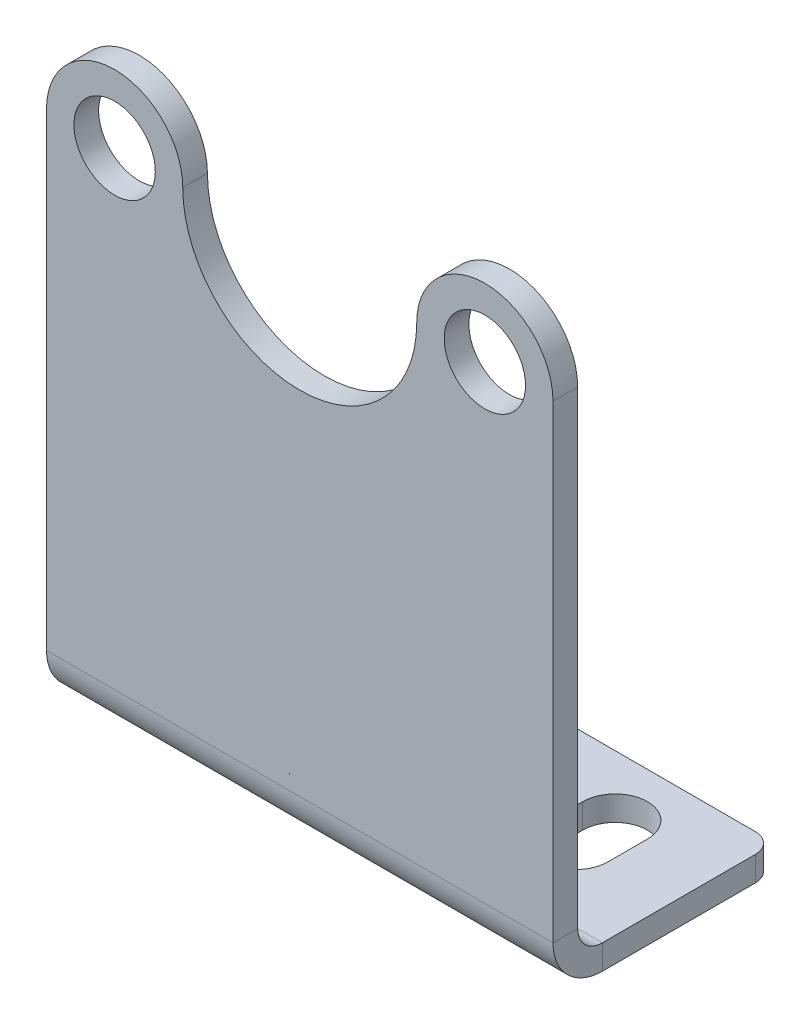
ISO-10303-21;
HEADER;
FILE_DESCRIPTION(('STEP AP214'),'2;1');
FILE_NAME('part.step','',(''),(''),'','','');
FILE_SCHEMA(('AUTOMOTIVE_DESIGN { 1 0 10303 214 1 1 1 1 }'));
ENDSEC;
DATA;
#1=APPLICATION_CONTEXT('core data for automotive mechanical design processes');
#2=APPLICATION_PROTOCOL_DEFINITION('international standard','automotive_design',2000,#1);
#3=PRODUCT_CONTEXT('',#1,'mechanical');
#4=PRODUCT('Part','Part','',(#3));
#5=PRODUCT_RELATED_PRODUCT_CATEGORY('part','',(#4));
#6=PRODUCT_DEFINITION_FORMATION('','',#4);
#7=PRODUCT_DEFINITION_CONTEXT('part definition',#1,'design');
#8=PRODUCT_DEFINITION('design','',#6,#7);
#9=PRODUCT_DEFINITION_SHAPE('','',#8);
#10=(LENGTH_UNIT() NAMED_UNIT(*) SI_UNIT(.MILLI.,.METRE.));
#11=(NAMED_UNIT(*) PLANE_ANGLE_UNIT() SI_UNIT($,.RADIAN.));
#12=(NAMED_UNIT(*) SI_UNIT($,.STERADIAN.) SOLID_ANGLE_UNIT());
#13=UNCERTAINTY_MEASURE_WITH_UNIT(LENGTH_MEASURE(1.E-05),#10,'distance_accuracy_value','');
#14=(GEOMETRIC_REPRESENTATION_CONTEXT(3) GLOBAL_UNCERTAINTY_ASSIGNED_CONTEXT((#13)) GLOBAL_UNIT_ASSIGNED_CONTEXT((#10,
#11,#12)) REPRESENTATION_CONTEXT('',''));
#15=CARTESIAN_POINT('',(0.,0.,0.));
#16=DIRECTION('',(0.,0.,1.));
#17=DIRECTION('',(1.,0.,0.));
#18=AXIS2_PLACEMENT_3D('',#15,#16,#17);
#19=CARTESIAN_POINT('',(-32.6263000000001,-14.5102681181538,0.));
#20=DIRECTION('',(-1.,0.,0.));
#21=DIRECTION('',(0.,-1.,0.));
#22=AXIS2_PLACEMENT_3D('',#19,#20,#21);
#23=PLANE('',#22);
#24=DIRECTION('',(0.,0.,-1.));
#25=VECTOR('',#24,1.);
#26=CARTESIAN_POINT('',(-32.6263000000001,-74.8352681181538,0.));
#27=LINE('',#26,#25);
#28=CARTESIAN_POINT('',(-32.6263000000001,-74.8352681181538,3.175));
#29=VERTEX_POINT('',#28);
#30=CARTESIAN_POINT('',(-32.6263000000001,-74.8352681181538,0.));
#31=VERTEX_POINT('',#30);
#32=EDGE_CURVE('E11',#29,#31,#27,.T.);
#33=ORIENTED_EDGE('',*,*,#32,.F.);
#34=DIRECTION('',(0.,1.,0.));
#35=VECTOR('',#34,1.);
#36=CARTESIAN_POINT('',(-32.6263000000001,-14.5102681181538,3.175));
#37=LINE('',#36,#35);
#38=CARTESIAN_POINT('',(-32.6263000000001,-14.5102681181538,3.175));
#39=VERTEX_POINT('',#38);
#40=EDGE_CURVE('E197',#39,#29,#37,.F.);
#41=ORIENTED_EDGE('',*,*,#40,.F.);
#42=DIRECTION('',(0.,0.,-1.));
#43=VECTOR('',#42,1.);
#44=CARTESIAN_POINT('',(-32.6263000000001,-14.5102681181538,0.));
#45=LINE('',#44,#43);
#46=CARTESIAN_POINT('',(-32.6263000000001,-14.5102681181538,0.));
#47=VERTEX_POINT('',#46);
#48=EDGE_CURVE('E53',#39,#47,#45,.T.);
#49=ORIENTED_EDGE('',*,*,#48,.T.);
#50=DIRECTION('',(0.,-1.,0.));
#51=VECTOR('',#50,1.);
#52=CARTESIAN_POINT('',(-32.6263000000001,-14.5102681181538,0.));
#53=LINE('',#52,#51);
#54=EDGE_CURVE('E289',#47,#31,#53,.T.);
#55=ORIENTED_EDGE('',*,*,#54,.T.);
#56=EDGE_LOOP('',(#33,#41,#49,#55));
#57=FACE_BOUND('',#56,.T.);
#58=ADVANCED_FACE('F42',(#57),#23,.T.);
#59=CARTESIAN_POINT('',(-23.8633000000001,-14.5102681181538,0.));
#60=DIRECTION('',(0.,0.,1.));
#61=DIRECTION('',(1.,0.,0.));
#62=AXIS2_PLACEMENT_3D('',#59,#60,#61);
#63=CYLINDRICAL_SURFACE('',#62,8.763);
#64=ORIENTED_EDGE('',*,*,#48,.F.);
#65=CARTESIAN_POINT('',(-23.8633000000001,-14.5102681181538,3.175));
#66=DIRECTION('',(0.,0.,1.));
#67=DIRECTION('',(1.,0.,0.));
#68=AXIS2_PLACEMENT_3D('',#65,#66,#67);
#69=CIRCLE('',#68,8.763);
#70=CARTESIAN_POINT('',(-15.1003000000001,-14.5102681181538,3.175));
#71=VERTEX_POINT('',#70);
#72=EDGE_CURVE('E207',#71,#39,#69,.T.);
#73=ORIENTED_EDGE('',*,*,#72,.F.);
#74=DIRECTION('',(0.,0.,-1.));
#75=VECTOR('',#74,1.);
#76=CARTESIAN_POINT('',(-15.1003000000001,-14.5102681181538,0.));
#77=LINE('',#76,#75);
#78=CARTESIAN_POINT('',(-15.1003000000001,-14.5102681181538,0.));
#79=VERTEX_POINT('',#78);
#80=EDGE_CURVE('E281',#71,#79,#77,.T.);
#81=ORIENTED_EDGE('',*,*,#80,.T.);
#82=CARTESIAN_POINT('',(-23.8633000000001,-14.5102681181538,0.));
#83=DIRECTION('',(0.,0.,1.));
#84=DIRECTION('',(1.,0.,0.));
#85=AXIS2_PLACEMENT_3D('',#82,#83,#84);
#86=CIRCLE('',#85,8.763);
#87=EDGE_CURVE('E302',#79,#47,#86,.T.);
#88=ORIENTED_EDGE('',*,*,#87,.T.);
#89=EDGE_LOOP('',(#64,#73,#81,#88));
#90=FACE_BOUND('',#89,.T.);
#91=ADVANCED_FACE('F309',(#90),#63,.T.);
#92=CARTESIAN_POINT('',(-0.0507999999999507,-14.5102681181538,0.));
#93=DIRECTION('',(0.,0.,1.));
#94=DIRECTION('',(1.,0.,0.));
#95=AXIS2_PLACEMENT_3D('',#92,#93,#94);
#96=CYLINDRICAL_SURFACE('',#95,15.0495000000001);
#97=ORIENTED_EDGE('',*,*,#80,.F.);
#98=CARTESIAN_POINT('',(-0.0507999999999507,-14.5102681181538,3.175));
#99=DIRECTION('',(0.,0.,-1.));
#100=DIRECTION('',(-1.,0.,0.));
#101=AXIS2_PLACEMENT_3D('',#98,#99,#100);
#102=CIRCLE('',#101,15.0495000000001);
#103=CARTESIAN_POINT('',(14.9987000000002,-14.5102681181538,3.175));
#104=VERTEX_POINT('',#103);
#105=EDGE_CURVE('E203',#104,#71,#102,.T.);
#106=ORIENTED_EDGE('',*,*,#105,.F.);
#107=DIRECTION('',(0.,0.,-1.));
#108=VECTOR('',#107,1.);
#109=CARTESIAN_POINT('',(14.9987000000002,-14.5102681181538,0.));
#110=LINE('',#109,#108);
#111=CARTESIAN_POINT('',(14.9987000000002,-14.5102681181538,0.));
#112=VERTEX_POINT('',#111);
#113=EDGE_CURVE('E277',#104,#112,#110,.T.);
#114=ORIENTED_EDGE('',*,*,#113,.T.);
#115=CARTESIAN_POINT('',(-0.0507999999999507,-14.5102681181538,0.));
#116=DIRECTION('',(0.,0.,-1.));
#117=DIRECTION('',(1.,0.,0.));
#118=AXIS2_PLACEMENT_3D('',#115,#116,#117);
#119=CIRCLE('',#118,15.0495000000001);
#120=EDGE_CURVE('E311',#112,#79,#119,.T.);
#121=ORIENTED_EDGE('',*,*,#120,.T.);
#122=EDGE_LOOP('',(#97,#106,#114,#121));
#123=FACE_BOUND('',#122,.T.);
#124=ADVANCED_FACE('F484',(#123),#96,.F.);
#125=CARTESIAN_POINT('',(23.7617000000002,-14.5102681181538,0.));
#126=DIRECTION('',(0.,0.,1.));
#127=DIRECTION('',(1.,0.,0.));
#128=AXIS2_PLACEMENT_3D('',#125,#126,#127);
#129=CYLINDRICAL_SURFACE('',#128,8.76299999999999);
#130=ORIENTED_EDGE('',*,*,#113,.F.);
#131=CARTESIAN_POINT('',(23.7617000000002,-14.5102681181538,3.175));
#132=DIRECTION('',(0.,0.,1.));
#133=DIRECTION('',(1.,0.,0.));
#134=AXIS2_PLACEMENT_3D('',#131,#132,#133);
#135=CIRCLE('',#134,8.76299999999999);
#136=CARTESIAN_POINT('',(32.5247000000001,-14.5102681181538,3.175));
#137=VERTEX_POINT('',#136);
#138=EDGE_CURVE('E198',#137,#104,#135,.T.);
#139=ORIENTED_EDGE('',*,*,#138,.F.);
#140=DIRECTION('',(0.,0.,-1.));
#141=VECTOR('',#140,1.);
#142=CARTESIAN_POINT('',(32.5247000000001,-14.5102681181538,0.));
#143=LINE('',#142,#141);
#144=CARTESIAN_POINT('',(32.5247000000001,-14.5102681181538,0.));
#145=VERTEX_POINT('',#144);
#146=EDGE_CURVE('E273',#137,#145,#143,.T.);
#147=ORIENTED_EDGE('',*,*,#146,.T.);
#148=CARTESIAN_POINT('',(23.7617000000002,-14.5102681181538,0.));
#149=DIRECTION('',(0.,0.,1.));
#150=DIRECTION('',(1.,0.,0.));
#151=AXIS2_PLACEMENT_3D('',#148,#149,#150);
#152=CIRCLE('',#151,8.76299999999999);
#153=EDGE_CURVE('E315',#145,#112,#152,.T.);
#154=ORIENTED_EDGE('',*,*,#153,.T.);
#155=EDGE_LOOP('',(#130,#139,#147,#154));
#156=FACE_BOUND('',#155,.T.);
#157=ADVANCED_FACE('F814',(#156),#129,.T.);
#158=CARTESIAN_POINT('',(32.5247000000002,-81.1852681181538,0.));
#159=DIRECTION('',(1.,0.,0.));
#160=DIRECTION('',(0.,1.,0.));
#161=AXIS2_PLACEMENT_3D('',#158,#159,#160);
#162=PLANE('',#161);
#163=ORIENTED_EDGE('',*,*,#146,.F.);
#164=DIRECTION('',(0.,1.,0.));
#165=VECTOR('',#164,1.);
#166=CARTESIAN_POINT('',(32.5247000000002,-14.5102681181538,3.175));
#167=LINE('',#166,#165);
#168=CARTESIAN_POINT('',(32.5247000000002,-74.8352681181538,3.175));
#169=VERTEX_POINT('',#168);
#170=EDGE_CURVE('E193',#169,#137,#167,.T.);
#171=ORIENTED_EDGE('',*,*,#170,.F.);
#172=DIRECTION('',(0.,0.,-1.));
#173=VECTOR('',#172,1.);
#174=CARTESIAN_POINT('',(32.5247000000002,-74.8352681181538,0.));
#175=LINE('',#174,#173);
#176=CARTESIAN_POINT('',(32.5247000000002,-74.8352681181538,0.));
#177=VERTEX_POINT('',#176);
#178=EDGE_CURVE('E269',#169,#177,#175,.T.);
#179=ORIENTED_EDGE('',*,*,#178,.T.);
#180=DIRECTION('',(0.,1.,0.));
#181=VECTOR('',#180,1.);
#182=CARTESIAN_POINT('',(32.5247000000002,-81.1852681181538,0.));
#183=LINE('',#182,#181);
#184=EDGE_CURVE('E307',#177,#145,#183,.T.);
#185=ORIENTED_EDGE('',*,*,#184,.T.);
#186=EDGE_LOOP('',(#163,#171,#179,#185));
#187=FACE_BOUND('',#186,.T.);
#188=ADVANCED_FACE('F477',(#187),#162,.T.);
#189=CARTESIAN_POINT('',(32.5247000000002,-74.8352681181538,-3.175));
#190=DIRECTION('',(1.,0.,0.));
#191=DIRECTION('',(0.,1.,0.));
#192=AXIS2_PLACEMENT_3D('',#189,#190,#191);
#193=PLANE('',#192);
#194=ORIENTED_EDGE('',*,*,#178,.F.);
#195=CARTESIAN_POINT('',(32.5247000000002,-74.8352681181538,-3.175));
#196=DIRECTION('',(-1.,0.,0.));
#197=DIRECTION('',(0.,0.,1.));
#198=AXIS2_PLACEMENT_3D('',#195,#196,#197);
#199=CIRCLE('',#198,6.35);
#200=CARTESIAN_POINT('',(32.5247000000002,-81.1852681181538,-3.175));
#201=VERTEX_POINT('',#200);
#202=EDGE_CURVE('E166',#169,#201,#199,.F.);
#203=ORIENTED_EDGE('',*,*,#202,.T.);
#204=DIRECTION('',(0.,1.,0.));
#205=VECTOR('',#204,1.);
#206=CARTESIAN_POINT('',(32.5247000000002,-78.0102681181538,-3.175));
#207=LINE('',#206,#205);
#208=CARTESIAN_POINT('',(32.5247000000002,-78.0102681181538,-3.175));
#209=VERTEX_POINT('',#208);
#210=EDGE_CURVE('E61',#201,#209,#207,.T.);
#211=ORIENTED_EDGE('',*,*,#210,.T.);
#212=CARTESIAN_POINT('',(32.5247000000002,-74.8352681181538,-3.175));
#213=DIRECTION('',(-1.,0.,0.));
#214=DIRECTION('',(0.,-1.,0.));
#215=AXIS2_PLACEMENT_3D('',#212,#213,#214);
#216=CIRCLE('',#215,3.175);
#217=EDGE_CURVE('E388',#177,#209,#216,.F.);
#218=ORIENTED_EDGE('',*,*,#217,.F.);
#219=EDGE_LOOP('',(#194,#203,#211,#218));
#220=FACE_BOUND('',#219,.T.);
#221=ADVANCED_FACE('F470',(#220),#193,.T.);
#222=CARTESIAN_POINT('',(32.5247000000002,-78.0102681181538,-25.4));
#223=DIRECTION('',(-1.,0.,0.));
#224=DIRECTION('',(0.,0.,1.));
#225=AXIS2_PLACEMENT_3D('',#222,#223,#224);
#226=PLANE('',#225);
#227=ORIENTED_EDGE('',*,*,#210,.F.);
#228=DIRECTION('',(0.,0.,1.));
#229=VECTOR('',#228,1.);
#230=CARTESIAN_POINT('',(32.5247000000002,-81.1852681181538,-25.4));
#231=LINE('',#230,#229);
#232=CARTESIAN_POINT('',(32.5247000000002,-81.1852681181538,-22.86));
#233=VERTEX_POINT('',#232);
#234=EDGE_CURVE('E156',#233,#201,#231,.T.);
#235=ORIENTED_EDGE('',*,*,#234,.F.);
#236=DIRECTION('',(0.,1.,0.));
#237=VECTOR('',#236,1.);
#238=CARTESIAN_POINT('',(32.5247000000002,-78.0102681181538,-22.86));
#239=LINE('',#238,#237);
#240=CARTESIAN_POINT('',(32.5247000000002,-78.0102681181538,-22.86));
#241=VERTEX_POINT('',#240);
#242=EDGE_CURVE('E263',#233,#241,#239,.T.);
#243=ORIENTED_EDGE('',*,*,#242,.T.);
#244=DIRECTION('',(0.,0.,1.));
#245=VECTOR('',#244,1.);
#246=CARTESIAN_POINT('',(32.5247000000002,-78.0102681181538,-25.4));
#247=LINE('',#246,#245);
#248=EDGE_CURVE('E373',#241,#209,#247,.T.);
#249=ORIENTED_EDGE('',*,*,#248,.T.);
#250=EDGE_LOOP('',(#227,#235,#243,#249));
#251=FACE_BOUND('',#250,.T.);
#252=ADVANCED_FACE('F468',(#251),#226,.F.);
#253=CARTESIAN_POINT('',(29.9847000000002,-78.0102681181538,-22.86));
#254=DIRECTION('',(0.,1.,0.));
#255=DIRECTION('',(0.,0.,1.));
#256=AXIS2_PLACEMENT_3D('',#253,#254,#255);
#257=CYLINDRICAL_SURFACE('',#256,2.54);
#258=ORIENTED_EDGE('',*,*,#242,.F.);
#259=CARTESIAN_POINT('',(29.9847000000002,-81.1852681181538,-22.86));
#260=DIRECTION('',(0.,1.,0.));
#261=DIRECTION('',(0.,0.,1.));
#262=AXIS2_PLACEMENT_3D('',#259,#260,#261);
#263=CIRCLE('',#262,2.54);
#264=CARTESIAN_POINT('',(29.9847000000002,-81.1852681181538,-25.4));
#265=VERTEX_POINT('',#264);
#266=EDGE_CURVE('E176',#233,#265,#263,.T.);
#267=ORIENTED_EDGE('',*,*,#266,.T.);
#268=DIRECTION('',(0.,1.,0.));
#269=VECTOR('',#268,1.);
#270=CARTESIAN_POINT('',(29.9847000000002,-78.0102681181538,-25.4));
#271=LINE('',#270,#269);
#272=CARTESIAN_POINT('',(29.9847000000002,-78.0102681181538,-25.4));
#273=VERTEX_POINT('',#272);
#274=EDGE_CURVE('E259',#265,#273,#271,.T.);
#275=ORIENTED_EDGE('',*,*,#274,.T.);
#276=CARTESIAN_POINT('',(29.9847000000002,-78.0102681181538,-22.86));
#277=DIRECTION('',(0.,1.,0.));
#278=DIRECTION('',(0.,0.,1.));
#279=AXIS2_PLACEMENT_3D('',#276,#277,#278);
#280=CIRCLE('',#279,2.54);
#281=EDGE_CURVE('E377',#241,#273,#280,.T.);
#282=ORIENTED_EDGE('',*,*,#281,.F.);
#283=EDGE_LOOP('',(#258,#267,#275,#282));
#284=FACE_BOUND('',#283,.T.);
#285=ADVANCED_FACE('F466',(#284),#257,.T.);
#286=CARTESIAN_POINT('',(32.5247000000002,-78.0102681181538,-25.4));
#287=DIRECTION('',(0.,0.,-1.));
#288=DIRECTION('',(-1.,0.,0.));
#289=AXIS2_PLACEMENT_3D('',#286,#287,#288);
#290=PLANE('',#289);
#291=ORIENTED_EDGE('',*,*,#274,.F.);
#292=DIRECTION('',(1.,0.,0.));
#293=VECTOR('',#292,1.);
#294=CARTESIAN_POINT('',(32.5247000000002,-81.1852681181538,-25.4));
#295=LINE('',#294,#293);
#296=CARTESIAN_POINT('',(-30.0863000000001,-81.1852681181538,-25.4));
#297=VERTEX_POINT('',#296);
#298=EDGE_CURVE('E178',#265,#297,#295,.F.);
#299=ORIENTED_EDGE('',*,*,#298,.T.);
#300=DIRECTION('',(0.,1.,0.));
#301=VECTOR('',#300,1.);
#302=CARTESIAN_POINT('',(-30.0863000000001,-78.0102681181538,-25.4));
#303=LINE('',#302,#301);
#304=CARTESIAN_POINT('',(-30.0863000000001,-78.0102681181538,-25.4));
#305=VERTEX_POINT('',#304);
#306=EDGE_CURVE('E255',#297,#305,#303,.T.);
#307=ORIENTED_EDGE('',*,*,#306,.T.);
#308=DIRECTION('',(-1.,0.,0.));
#309=VECTOR('',#308,1.);
#310=CARTESIAN_POINT('',(32.5247000000002,-78.0102681181538,-25.4));
#311=LINE('',#310,#309);
#312=EDGE_CURVE('E362',#273,#305,#311,.T.);
#313=ORIENTED_EDGE('',*,*,#312,.F.);
#314=EDGE_LOOP('',(#291,#299,#307,#313));
#315=FACE_BOUND('',#314,.T.);
#316=ADVANCED_FACE('F464',(#315),#290,.T.);
#317=CARTESIAN_POINT('',(-30.0863000000001,-78.0102681181538,-22.86));
#318=DIRECTION('',(0.,1.,0.));
#319=DIRECTION('',(0.,0.,1.));
#320=AXIS2_PLACEMENT_3D('',#317,#318,#319);
#321=CYLINDRICAL_SURFACE('',#320,2.54);
#322=ORIENTED_EDGE('',*,*,#306,.F.);
#323=CARTESIAN_POINT('',(-30.0863000000001,-81.1852681181538,-22.86));
#324=DIRECTION('',(0.,1.,0.));
#325=DIRECTION('',(0.,0.,1.));
#326=AXIS2_PLACEMENT_3D('',#323,#324,#325);
#327=CIRCLE('',#326,2.54);
#328=CARTESIAN_POINT('',(-32.6263000000001,-81.1852681181538,-22.86));
#329=VERTEX_POINT('',#328);
#330=EDGE_CURVE('E171',#297,#329,#327,.T.);
#331=ORIENTED_EDGE('',*,*,#330,.T.);
#332=DIRECTION('',(0.,1.,0.));
#333=VECTOR('',#332,1.);
#334=CARTESIAN_POINT('',(-32.6263000000001,-78.0102681181538,-22.86));
#335=LINE('',#334,#333);
#336=CARTESIAN_POINT('',(-32.6263000000001,-78.0102681181538,-22.86));
#337=VERTEX_POINT('',#336);
#338=EDGE_CURVE('E143',#329,#337,#335,.T.);
#339=ORIENTED_EDGE('',*,*,#338,.T.);
#340=CARTESIAN_POINT('',(-30.0863000000001,-78.0102681181538,-22.86));
#341=DIRECTION('',(0.,1.,0.));
#342=DIRECTION('',(0.,0.,1.));
#343=AXIS2_PLACEMENT_3D('',#340,#341,#342);
#344=CIRCLE('',#343,2.54);
#345=EDGE_CURVE('E366',#305,#337,#344,.T.);
#346=ORIENTED_EDGE('',*,*,#345,.F.);
#347=EDGE_LOOP('',(#322,#331,#339,#346));
#348=FACE_BOUND('',#347,.T.);
#349=ADVANCED_FACE('F461',(#348),#321,.T.);
#350=CARTESIAN_POINT('',(-32.6263000000001,-78.0102681181538,-25.4));
#351=DIRECTION('',(-1.,0.,0.));
#352=DIRECTION('',(0.,0.,1.));
#353=AXIS2_PLACEMENT_3D('',#350,#351,#352);
#354=PLANE('',#353);
#355=ORIENTED_EDGE('',*,*,#338,.F.);
#356=DIRECTION('',(0.,0.,1.));
#357=VECTOR('',#356,1.);
#358=CARTESIAN_POINT('',(-32.6263000000001,-81.1852681181538,-25.4));
#359=LINE('',#358,#357);
#360=CARTESIAN_POINT('',(-32.6263000000001,-81.1852681181538,-3.175));
#361=VERTEX_POINT('',#360);
#362=EDGE_CURVE('E152',#329,#361,#359,.T.);
#363=ORIENTED_EDGE('',*,*,#362,.T.);
#364=DIRECTION('',(0.,1.,0.));
#365=VECTOR('',#364,1.);
#366=CARTESIAN_POINT('',(-32.6263000000001,-78.0102681181538,-3.175));
#367=LINE('',#366,#365);
#368=CARTESIAN_POINT('',(-32.6263000000001,-78.0102681181538,-3.175));
#369=VERTEX_POINT('',#368);
#370=EDGE_CURVE('E46',#361,#369,#367,.T.);
#371=ORIENTED_EDGE('',*,*,#370,.T.);
#372=DIRECTION('',(0.,0.,1.));
#373=VECTOR('',#372,1.);
#374=CARTESIAN_POINT('',(-32.6263000000001,-78.0102681181538,-25.4));
#375=LINE('',#374,#373);
#376=EDGE_CURVE('E370',#337,#369,#375,.T.);
#377=ORIENTED_EDGE('',*,*,#376,.F.);
#378=EDGE_LOOP('',(#355,#363,#371,#377));
#379=FACE_BOUND('',#378,.T.);
#380=ADVANCED_FACE('F168',(#379),#354,.T.);
#381=CARTESIAN_POINT('',(-20.2946465845419,-78.0102681181538,-17.6342737517995));
#382=DIRECTION('',(0.,1.,0.));
#383=DIRECTION('',(0.,0.,1.));
#384=AXIS2_PLACEMENT_3D('',#381,#382,#383);
#385=CYLINDRICAL_SURFACE('',#384,4.1671875);
#386=DIRECTION('',(0.,1.,0.));
#387=VECTOR('',#386,1.);
#388=CARTESIAN_POINT('',(-24.4618340845419,-78.0102681181538,-17.6342737517995));
#389=LINE('',#388,#387);
#390=CARTESIAN_POINT('',(-24.4618340845419,-81.1852681181538,-17.6342737517995));
#391=VERTEX_POINT('',#390);
#392=CARTESIAN_POINT('',(-24.4618340845419,-78.0102681181538,-17.6342737517995));
#393=VERTEX_POINT('',#392);
#394=EDGE_CURVE('E144',#391,#393,#389,.T.);
#395=ORIENTED_EDGE('',*,*,#394,.F.);
#396=CARTESIAN_POINT('',(-20.2946465845419,-81.1852681181538,-17.6342737517995));
#397=DIRECTION('',(0.,1.,0.));
#398=DIRECTION('',(0.,0.,1.));
#399=AXIS2_PLACEMENT_3D('',#396,#397,#398);
#400=CIRCLE('',#399,4.1671875);
#401=CARTESIAN_POINT('',(-16.1274590845419,-81.1852681181538,-17.6342737517995));
#402=VERTEX_POINT('',#401);
#403=EDGE_CURVE('E414',#402,#391,#400,.T.);
#404=ORIENTED_EDGE('',*,*,#403,.F.);
#405=DIRECTION('',(0.,1.,0.));
#406=VECTOR('',#405,1.);
#407=CARTESIAN_POINT('',(-16.1274590845419,-78.0102681181538,-17.6342737517995));
#408=LINE('',#407,#406);
#409=CARTESIAN_POINT('',(-16.1274590845419,-78.0102681181538,-17.6342737517995));
#410=VERTEX_POINT('',#409);
#411=EDGE_CURVE('E243',#402,#410,#408,.T.);
#412=ORIENTED_EDGE('',*,*,#411,.T.);
#413=CARTESIAN_POINT('',(-20.2946465845419,-78.0102681181538,-17.6342737517995));
#414=DIRECTION('',(0.,1.,0.));
#415=DIRECTION('',(0.,0.,1.));
#416=AXIS2_PLACEMENT_3D('',#413,#414,#415);
#417=CIRCLE('',#416,4.1671875);
#418=EDGE_CURVE('E354',#410,#393,#417,.T.);
#419=ORIENTED_EDGE('',*,*,#418,.T.);
#420=EDGE_LOOP('',(#395,#404,#412,#419));
#421=FACE_BOUND('',#420,.T.);
#422=ADVANCED_FACE('F536',(#421),#385,.F.);
#423=CARTESIAN_POINT('',(-16.1274590845419,-78.0102681181538,-12.5542737517995));
#424=DIRECTION('',(1.,0.,0.));
#425=DIRECTION('',(0.,0.,-1.));
#426=AXIS2_PLACEMENT_3D('',#423,#424,#425);
#427=PLANE('',#426);
#428=ORIENTED_EDGE('',*,*,#411,.F.);
#429=DIRECTION('',(0.,0.,1.));
#430=VECTOR('',#429,1.);
#431=CARTESIAN_POINT('',(-16.1274590845419,-81.1852681181538,-25.4));
#432=LINE('',#431,#430);
#433=CARTESIAN_POINT('',(-16.1274590845419,-81.1852681181538,-12.5542737517995));
#434=VERTEX_POINT('',#433);
#435=EDGE_CURVE('E187',#434,#402,#432,.F.);
#436=ORIENTED_EDGE('',*,*,#435,.F.);
#437=DIRECTION('',(0.,1.,0.));
#438=VECTOR('',#437,1.);
#439=CARTESIAN_POINT('',(-16.1274590845419,-78.0102681181538,-12.5542737517995));
#440=LINE('',#439,#438);
#441=CARTESIAN_POINT('',(-16.1274590845419,-78.0102681181538,-12.5542737517995));
#442=VERTEX_POINT('',#441);
#443=EDGE_CURVE('E239',#434,#442,#440,.T.);
#444=ORIENTED_EDGE('',*,*,#443,.T.);
#445=DIRECTION('',(0.,0.,-1.));
#446=VECTOR('',#445,1.);
#447=CARTESIAN_POINT('',(-16.1274590845419,-78.0102681181538,-12.5542737517995));
#448=LINE('',#447,#446);
#449=EDGE_CURVE('E358',#442,#410,#448,.T.);
#450=ORIENTED_EDGE('',*,*,#449,.T.);
#451=EDGE_LOOP('',(#428,#436,#444,#450));
#452=FACE_BOUND('',#451,.T.);
#453=ADVANCED_FACE('F437',(#452),#427,.F.);
#454=CARTESIAN_POINT('',(-20.2946465845419,-78.0102681181538,-12.5542737517995));
#455=DIRECTION('',(0.,1.,0.));
#456=DIRECTION('',(0.,0.,1.));
#457=AXIS2_PLACEMENT_3D('',#454,#455,#456);
#458=CYLINDRICAL_SURFACE('',#457,4.1671875);
#459=ORIENTED_EDGE('',*,*,#443,.F.);
#460=CARTESIAN_POINT('',(-20.2946465845419,-81.1852681181538,-12.5542737517995));
#461=DIRECTION('',(0.,1.,0.));
#462=DIRECTION('',(0.,0.,1.));
#463=AXIS2_PLACEMENT_3D('',#460,#461,#462);
#464=CIRCLE('',#463,4.1671875);
#465=CARTESIAN_POINT('',(-24.4618340845419,-81.1852681181538,-12.5542737517995));
#466=VERTEX_POINT('',#465);
#467=EDGE_CURVE('E401',#466,#434,#464,.T.);
#468=ORIENTED_EDGE('',*,*,#467,.F.);
#469=DIRECTION('',(0.,1.,0.));
#470=VECTOR('',#469,1.);
#471=CARTESIAN_POINT('',(-24.4618340845419,-78.0102681181538,-12.5542737517995));
#472=LINE('',#471,#470);
#473=CARTESIAN_POINT('',(-24.4618340845419,-78.0102681181538,-12.5542737517995));
#474=VERTEX_POINT('',#473);
#475=EDGE_CURVE('E234',#466,#474,#472,.T.);
#476=ORIENTED_EDGE('',*,*,#475,.T.);
#477=CARTESIAN_POINT('',(-20.2946465845419,-78.0102681181538,-12.5542737517995));
#478=DIRECTION('',(0.,1.,0.));
#479=DIRECTION('',(0.,0.,1.));
#480=AXIS2_PLACEMENT_3D('',#477,#478,#479);
#481=CIRCLE('',#480,4.1671875);
#482=EDGE_CURVE('E346',#474,#442,#481,.T.);
#483=ORIENTED_EDGE('',*,*,#482,.T.);
#484=EDGE_LOOP('',(#459,#468,#476,#483));
#485=FACE_BOUND('',#484,.T.);
#486=ADVANCED_FACE('F431',(#485),#458,.F.);
#487=CARTESIAN_POINT('',(19.7053534154581,-78.0102681181538,-17.6342737517995));
#488=DIRECTION('',(0.,1.,0.));
#489=DIRECTION('',(0.,0.,1.));
#490=AXIS2_PLACEMENT_3D('',#487,#488,#489);
#491=CYLINDRICAL_SURFACE('',#490,4.1671875);
#492=DIRECTION('',(0.,1.,0.));
#493=VECTOR('',#492,1.);
#494=CARTESIAN_POINT('',(15.5381659154581,-78.0102681181538,-17.6342737517995));
#495=LINE('',#494,#493);
#496=CARTESIAN_POINT('',(15.5381659154581,-81.1852681181538,-17.6342737517995));
#497=VERTEX_POINT('',#496);
#498=CARTESIAN_POINT('',(15.5381659154581,-78.0102681181538,-17.6342737517995));
#499=VERTEX_POINT('',#498);
#500=EDGE_CURVE('E230',#497,#499,#495,.T.);
#501=ORIENTED_EDGE('',*,*,#500,.F.);
#502=CARTESIAN_POINT('',(19.7053534154581,-81.1852681181538,-17.6342737517995));
#503=DIRECTION('',(0.,1.,0.));
#504=DIRECTION('',(0.,0.,1.));
#505=AXIS2_PLACEMENT_3D('',#502,#503,#504);
#506=CIRCLE('',#505,4.1671875);
#507=CARTESIAN_POINT('',(23.8725409154581,-81.1852681181538,-17.6342737517995));
#508=VERTEX_POINT('',#507);
#509=EDGE_CURVE('E402',#508,#497,#506,.T.);
#510=ORIENTED_EDGE('',*,*,#509,.F.);
#511=DIRECTION('',(0.,1.,0.));
#512=VECTOR('',#511,1.);
#513=CARTESIAN_POINT('',(23.8725409154581,-78.0102681181538,-17.6342737517995));
#514=LINE('',#513,#512);
#515=CARTESIAN_POINT('',(23.8725409154581,-78.0102681181538,-17.6342737517995));
#516=VERTEX_POINT('',#515);
#517=EDGE_CURVE('E225',#508,#516,#514,.T.);
#518=ORIENTED_EDGE('',*,*,#517,.T.);
#519=CARTESIAN_POINT('',(19.7053534154581,-78.0102681181538,-17.6342737517995));
#520=DIRECTION('',(0.,1.,0.));
#521=DIRECTION('',(0.,0.,1.));
#522=AXIS2_PLACEMENT_3D('',#519,#520,#521);
#523=CIRCLE('',#522,4.1671875);
#524=EDGE_CURVE('E338',#516,#499,#523,.T.);
#525=ORIENTED_EDGE('',*,*,#524,.T.);
#526=EDGE_LOOP('',(#501,#510,#518,#525));
#527=FACE_BOUND('',#526,.T.);
#528=ADVANCED_FACE('F524',(#527),#491,.F.);
#529=CARTESIAN_POINT('',(23.8725409154581,-78.0102681181538,-12.5542737517995));
#530=DIRECTION('',(1.,0.,0.));
#531=DIRECTION('',(0.,0.,-1.));
#532=AXIS2_PLACEMENT_3D('',#529,#530,#531);
#533=PLANE('',#532);
#534=ORIENTED_EDGE('',*,*,#517,.F.);
#535=DIRECTION('',(0.,0.,1.));
#536=VECTOR('',#535,1.);
#537=CARTESIAN_POINT('',(23.8725409154581,-81.1852681181538,-25.4));
#538=LINE('',#537,#536);
#539=CARTESIAN_POINT('',(23.8725409154581,-81.1852681181538,-12.5542737517995));
#540=VERTEX_POINT('',#539);
#541=EDGE_CURVE('E397',#540,#508,#538,.F.);
#542=ORIENTED_EDGE('',*,*,#541,.F.);
#543=DIRECTION('',(0.,1.,0.));
#544=VECTOR('',#543,1.);
#545=CARTESIAN_POINT('',(23.8725409154581,-78.0102681181538,-12.5542737517995));
#546=LINE('',#545,#544);
#547=CARTESIAN_POINT('',(23.8725409154581,-78.0102681181538,-12.5542737517995));
#548=VERTEX_POINT('',#547);
#549=EDGE_CURVE('E221',#540,#548,#546,.T.);
#550=ORIENTED_EDGE('',*,*,#549,.T.);
#551=DIRECTION('',(0.,0.,-1.));
#552=VECTOR('',#551,1.);
#553=CARTESIAN_POINT('',(23.8725409154581,-78.0102681181538,-12.5542737517995));
#554=LINE('',#553,#552);
#555=EDGE_CURVE('E342',#548,#516,#554,.T.);
#556=ORIENTED_EDGE('',*,*,#555,.T.);
#557=EDGE_LOOP('',(#534,#542,#550,#556));
#558=FACE_BOUND('',#557,.T.);
#559=ADVANCED_FACE('F499',(#558),#533,.F.);
#560=CARTESIAN_POINT('',(19.7053534154581,-78.0102681181538,-12.5542737517995));
#561=DIRECTION('',(0.,1.,0.));
#562=DIRECTION('',(0.,0.,1.));
#563=AXIS2_PLACEMENT_3D('',#560,#561,#562);
#564=CYLINDRICAL_SURFACE('',#563,4.1671875);
#565=ORIENTED_EDGE('',*,*,#549,.F.);
#566=CARTESIAN_POINT('',(19.7053534154581,-81.1852681181538,-12.5542737517995));
#567=DIRECTION('',(0.,1.,0.));
#568=DIRECTION('',(0.,0.,1.));
#569=AXIS2_PLACEMENT_3D('',#566,#567,#568);
#570=CIRCLE('',#569,4.1671875);
#571=CARTESIAN_POINT('',(15.5381659154581,-81.1852681181538,-12.5542737517995));
#572=VERTEX_POINT('',#571);
#573=EDGE_CURVE('E220',#572,#540,#570,.T.);
#574=ORIENTED_EDGE('',*,*,#573,.F.);
#575=DIRECTION('',(0.,1.,0.));
#576=VECTOR('',#575,1.);
#577=CARTESIAN_POINT('',(15.5381659154581,-78.0102681181538,-12.5542737517995));
#578=LINE('',#577,#576);
#579=CARTESIAN_POINT('',(15.5381659154581,-78.0102681181538,-12.5542737517995));
#580=VERTEX_POINT('',#579);
#581=EDGE_CURVE('E226',#572,#580,#578,.T.);
#582=ORIENTED_EDGE('',*,*,#581,.T.);
#583=CARTESIAN_POINT('',(19.7053534154581,-78.0102681181538,-12.5542737517995));
#584=DIRECTION('',(0.,1.,0.));
#585=DIRECTION('',(0.,0.,1.));
#586=AXIS2_PLACEMENT_3D('',#583,#584,#585);
#587=CIRCLE('',#586,4.1671875);
#588=EDGE_CURVE('E330',#580,#548,#587,.T.);
#589=ORIENTED_EDGE('',*,*,#588,.T.);
#590=EDGE_LOOP('',(#565,#574,#582,#589));
#591=FACE_BOUND('',#590,.T.);
#592=ADVANCED_FACE('F491',(#591),#564,.F.);
#593=CARTESIAN_POINT('',(-23.8633000000001,-14.5102681181538,0.));
#594=DIRECTION('',(0.,0.,1.));
#595=DIRECTION('',(1.,0.,0.));
#596=AXIS2_PLACEMENT_3D('',#593,#594,#595);
#597=CYLINDRICAL_SURFACE('',#596,5.2324);
#598=CARTESIAN_POINT('',(-23.8633000000001,-14.5102681181538,0.));
#599=DIRECTION('',(0.,0.,1.));
#600=DIRECTION('',(1.,0.,0.));
#601=AXIS2_PLACEMENT_3D('',#598,#599,#600);
#602=CIRCLE('',#601,5.2324);
#603=CARTESIAN_POINT('',(-18.6309000000001,-14.5102681181538,0.));
#604=VERTEX_POINT('',#603);
#605=EDGE_CURVE('E322',#604,#604,#602,.T.);
#606=ORIENTED_EDGE('',*,*,#605,.F.);
#607=EDGE_LOOP('',(#606));
#608=FACE_BOUND('',#607,.T.);
#609=CARTESIAN_POINT('',(-23.8633000000001,-14.5102681181538,3.175));
#610=DIRECTION('',(0.,0.,1.));
#611=DIRECTION('',(1.,0.,0.));
#612=AXIS2_PLACEMENT_3D('',#609,#610,#611);
#613=CIRCLE('',#612,5.2324);
#614=CARTESIAN_POINT('',(-18.6309000000001,-14.5102681181538,3.175));
#615=VERTEX_POINT('',#614);
#616=EDGE_CURVE('E202',#615,#615,#613,.T.);
#617=ORIENTED_EDGE('',*,*,#616,.T.);
#618=EDGE_LOOP('',(#617));
#619=FACE_BOUND('',#618,.T.);
#620=ADVANCED_FACE('F489',(#608,#619),#597,.F.);
#621=CARTESIAN_POINT('',(23.7617000000002,-14.5102681181538,0.));
#622=DIRECTION('',(0.,0.,1.));
#623=DIRECTION('',(1.,0.,0.));
#624=AXIS2_PLACEMENT_3D('',#621,#622,#623);
#625=CYLINDRICAL_SURFACE('',#624,5.2324);
#626=CARTESIAN_POINT('',(23.7617000000002,-14.5102681181538,0.));
#627=DIRECTION('',(0.,0.,1.));
#628=DIRECTION('',(1.,0.,0.));
#629=AXIS2_PLACEMENT_3D('',#626,#627,#628);
#630=CIRCLE('',#629,5.2324);
#631=CARTESIAN_POINT('',(28.9941000000002,-14.5102681181538,0.));
#632=VERTEX_POINT('',#631);
#633=EDGE_CURVE('E326',#632,#632,#630,.T.);
#634=ORIENTED_EDGE('',*,*,#633,.F.);
#635=EDGE_LOOP('',(#634));
#636=FACE_BOUND('',#635,.T.);
#637=CARTESIAN_POINT('',(23.7617000000002,-14.5102681181538,3.175));
#638=DIRECTION('',(0.,0.,1.));
#639=DIRECTION('',(1.,0.,0.));
#640=AXIS2_PLACEMENT_3D('',#637,#638,#639);
#641=CIRCLE('',#640,5.2324);
#642=CARTESIAN_POINT('',(28.9941000000002,-14.5102681181538,3.175));
#643=VERTEX_POINT('',#642);
#644=EDGE_CURVE('E216',#643,#643,#641,.T.);
#645=ORIENTED_EDGE('',*,*,#644,.T.);
#646=EDGE_LOOP('',(#645));
#647=FACE_BOUND('',#646,.T.);
#648=ADVANCED_FACE('F44',(#636,#647),#625,.F.);
#649=CARTESIAN_POINT('',(15.5381659154581,-78.0102681181538,-12.5542737517995));
#650=DIRECTION('',(1.,0.,0.));
#651=DIRECTION('',(0.,0.,-1.));
#652=AXIS2_PLACEMENT_3D('',#649,#650,#651);
#653=PLANE('',#652);
#654=DIRECTION('',(0.,0.,1.));
#655=VECTOR('',#654,1.);
#656=CARTESIAN_POINT('',(15.5381659154581,-81.1852681181538,-25.4));
#657=LINE('',#656,#655);
#658=EDGE_CURVE('E396',#572,#497,#657,.F.);
#659=ORIENTED_EDGE('',*,*,#658,.T.);
#660=ORIENTED_EDGE('',*,*,#500,.T.);
#661=DIRECTION('',(0.,0.,-1.));
#662=VECTOR('',#661,1.);
#663=CARTESIAN_POINT('',(15.5381659154581,-78.0102681181538,-12.5542737517995));
#664=LINE('',#663,#662);
#665=EDGE_CURVE('E334',#580,#499,#664,.T.);
#666=ORIENTED_EDGE('',*,*,#665,.F.);
#667=ORIENTED_EDGE('',*,*,#581,.F.);
#668=EDGE_LOOP('',(#659,#660,#666,#667));
#669=FACE_BOUND('',#668,.T.);
#670=ADVANCED_FACE('F497',(#669),#653,.T.);
#671=CARTESIAN_POINT('',(-24.4618340845419,-78.0102681181538,-12.5542737517995));
#672=DIRECTION('',(1.,0.,0.));
#673=DIRECTION('',(0.,0.,-1.));
#674=AXIS2_PLACEMENT_3D('',#671,#672,#673);
#675=PLANE('',#674);
#676=DIRECTION('',(0.,0.,1.));
#677=VECTOR('',#676,1.);
#678=CARTESIAN_POINT('',(-24.4618340845419,-81.1852681181538,-25.4));
#679=LINE('',#678,#677);
#680=EDGE_CURVE('E181',#466,#391,#679,.F.);
#681=ORIENTED_EDGE('',*,*,#680,.T.);
#682=ORIENTED_EDGE('',*,*,#394,.T.);
#683=DIRECTION('',(0.,0.,-1.));
#684=VECTOR('',#683,1.);
#685=CARTESIAN_POINT('',(-24.4618340845419,-78.0102681181538,-12.5542737517995));
#686=LINE('',#685,#684);
#687=EDGE_CURVE('E350',#474,#393,#686,.T.);
#688=ORIENTED_EDGE('',*,*,#687,.F.);
#689=ORIENTED_EDGE('',*,*,#475,.F.);
#690=EDGE_LOOP('',(#681,#682,#688,#689));
#691=FACE_BOUND('',#690,.T.);
#692=ADVANCED_FACE('F425',(#691),#675,.T.);
#693=CARTESIAN_POINT('',(-32.6263000000001,-74.8352681181538,-3.175));
#694=DIRECTION('',(1.,0.,0.));
#695=DIRECTION('',(0.,1.,0.));
#696=AXIS2_PLACEMENT_3D('',#693,#694,#695);
#697=PLANE('',#696);
#698=CARTESIAN_POINT('',(-32.6263000000001,-74.8352681181538,-3.175));
#699=DIRECTION('',(-1.,0.,0.));
#700=DIRECTION('',(0.,0.,1.));
#701=AXIS2_PLACEMENT_3D('',#698,#699,#700);
#702=CIRCLE('',#701,6.35);
#703=EDGE_CURVE('E134',#361,#29,#702,.T.);
#704=ORIENTED_EDGE('',*,*,#703,.T.);
#705=ORIENTED_EDGE('',*,*,#32,.T.);
#706=CARTESIAN_POINT('',(-32.6263000000001,-74.8352681181538,-3.175));
#707=DIRECTION('',(-1.,0.,0.));
#708=DIRECTION('',(0.,-1.,0.));
#709=AXIS2_PLACEMENT_3D('',#706,#707,#708);
#710=CIRCLE('',#709,3.175);
#711=EDGE_CURVE('E136',#369,#31,#710,.T.);
#712=ORIENTED_EDGE('',*,*,#711,.F.);
#713=ORIENTED_EDGE('',*,*,#370,.F.);
#714=EDGE_LOOP('',(#704,#705,#712,#713));
#715=FACE_BOUND('',#714,.T.);
#716=ADVANCED_FACE('F132',(#715),#697,.F.);
#717=CARTESIAN_POINT('',(32.5247000000002,-78.0102681181538,-25.4));
#718=DIRECTION('',(0.,1.,0.));
#719=DIRECTION('',(0.,0.,1.));
#720=AXIS2_PLACEMENT_3D('',#717,#718,#719);
#721=PLANE('',#720);
#722=ORIENTED_EDGE('',*,*,#588,.F.);
#723=ORIENTED_EDGE('',*,*,#665,.T.);
#724=ORIENTED_EDGE('',*,*,#524,.F.);
#725=ORIENTED_EDGE('',*,*,#555,.F.);
#726=EDGE_LOOP('',(#722,#723,#724,#725));
#727=FACE_BOUND('',#726,.T.);
#728=ORIENTED_EDGE('',*,*,#482,.F.);
#729=ORIENTED_EDGE('',*,*,#687,.T.);
#730=ORIENTED_EDGE('',*,*,#418,.F.);
#731=ORIENTED_EDGE('',*,*,#449,.F.);
#732=EDGE_LOOP('',(#728,#729,#730,#731));
#733=FACE_BOUND('',#732,.T.);
#734=ORIENTED_EDGE('',*,*,#376,.T.);
#735=DIRECTION('',(-1.,0.,0.));
#736=VECTOR('',#735,1.);
#737=CARTESIAN_POINT('',(32.5247000000002,-78.0102681181538,-3.175));
#738=LINE('',#737,#736);
#739=EDGE_CURVE('E238',#369,#209,#738,.F.);
#740=ORIENTED_EDGE('',*,*,#739,.T.);
#741=ORIENTED_EDGE('',*,*,#248,.F.);
#742=ORIENTED_EDGE('',*,*,#281,.T.);
#743=ORIENTED_EDGE('',*,*,#312,.T.);
#744=ORIENTED_EDGE('',*,*,#345,.T.);
#745=EDGE_LOOP('',(#734,#740,#741,#742,#743,#744));
#746=FACE_BOUND('',#745,.T.);
#747=ADVANCED_FACE('F456',(#727,#733,#746),#721,.T.);
#748=CARTESIAN_POINT('',(23.7617000000002,-14.5102681181538,0.));
#749=DIRECTION('',(0.,0.,1.));
#750=DIRECTION('',(1.,0.,0.));
#751=AXIS2_PLACEMENT_3D('',#748,#749,#750);
#752=PLANE('',#751);
#753=ORIENTED_EDGE('',*,*,#184,.F.);
#754=DIRECTION('',(-1.,0.,0.));
#755=VECTOR('',#754,1.);
#756=CARTESIAN_POINT('',(23.7617000000002,-74.8352681181538,0.));
#757=LINE('',#756,#755);
#758=EDGE_CURVE('E305',#177,#31,#757,.T.);
#759=ORIENTED_EDGE('',*,*,#758,.T.);
#760=ORIENTED_EDGE('',*,*,#54,.F.);
#761=ORIENTED_EDGE('',*,*,#87,.F.);
#762=ORIENTED_EDGE('',*,*,#120,.F.);
#763=ORIENTED_EDGE('',*,*,#153,.F.);
#764=EDGE_LOOP('',(#753,#759,#760,#761,#762,#763));
#765=FACE_BOUND('',#764,.T.);
#766=ORIENTED_EDGE('',*,*,#605,.T.);
#767=EDGE_LOOP('',(#766));
#768=FACE_BOUND('',#767,.T.);
#769=ORIENTED_EDGE('',*,*,#633,.T.);
#770=EDGE_LOOP('',(#769));
#771=FACE_BOUND('',#770,.T.);
#772=ADVANCED_FACE('F299',(#765,#768,#771),#752,.F.);
#773=CARTESIAN_POINT('',(23.7617000000002,-74.8352681181538,-3.175));
#774=DIRECTION('',(-1.,0.,0.));
#775=DIRECTION('',(0.,0.,1.));
#776=AXIS2_PLACEMENT_3D('',#773,#774,#775);
#777=CYLINDRICAL_SURFACE('',#776,3.175);
#778=ORIENTED_EDGE('',*,*,#217,.T.);
#779=ORIENTED_EDGE('',*,*,#739,.F.);
#780=ORIENTED_EDGE('',*,*,#711,.T.);
#781=ORIENTED_EDGE('',*,*,#758,.F.);
#782=EDGE_LOOP('',(#778,#779,#780,#781));
#783=FACE_BOUND('',#782,.T.);
#784=ADVANCED_FACE('F453',(#783),#777,.F.);
#785=CARTESIAN_POINT('',(32.5247000000002,-81.1852681181538,-25.4));
#786=DIRECTION('',(0.,1.,0.));
#787=DIRECTION('',(0.,0.,1.));
#788=AXIS2_PLACEMENT_3D('',#785,#786,#787);
#789=PLANE('',#788);
#790=ORIENTED_EDGE('',*,*,#573,.T.);
#791=ORIENTED_EDGE('',*,*,#541,.T.);
#792=ORIENTED_EDGE('',*,*,#509,.T.);
#793=ORIENTED_EDGE('',*,*,#658,.F.);
#794=EDGE_LOOP('',(#790,#791,#792,#793));
#795=FACE_BOUND('',#794,.T.);
#796=ORIENTED_EDGE('',*,*,#467,.T.);
#797=ORIENTED_EDGE('',*,*,#435,.T.);
#798=ORIENTED_EDGE('',*,*,#403,.T.);
#799=ORIENTED_EDGE('',*,*,#680,.F.);
#800=EDGE_LOOP('',(#796,#797,#798,#799));
#801=FACE_BOUND('',#800,.T.);
#802=ORIENTED_EDGE('',*,*,#362,.F.);
#803=ORIENTED_EDGE('',*,*,#330,.F.);
#804=ORIENTED_EDGE('',*,*,#298,.F.);
#805=ORIENTED_EDGE('',*,*,#266,.F.);
#806=ORIENTED_EDGE('',*,*,#234,.T.);
#807=DIRECTION('',(1.,0.,0.));
#808=VECTOR('',#807,1.);
#809=CARTESIAN_POINT('',(32.5247000000002,-81.1852681181538,-3.175));
#810=LINE('',#809,#808);
#811=EDGE_CURVE('E149',#361,#201,#810,.T.);
#812=ORIENTED_EDGE('',*,*,#811,.F.);
#813=EDGE_LOOP('',(#802,#803,#804,#805,#806,#812));
#814=FACE_BOUND('',#813,.T.);
#815=ADVANCED_FACE('F150',(#795,#801,#814),#789,.F.);
#816=CARTESIAN_POINT('',(23.7617000000002,-14.5102681181538,3.175));
#817=DIRECTION('',(0.,0.,1.));
#818=DIRECTION('',(1.,0.,0.));
#819=AXIS2_PLACEMENT_3D('',#816,#817,#818);
#820=PLANE('',#819);
#821=ORIENTED_EDGE('',*,*,#170,.T.);
#822=ORIENTED_EDGE('',*,*,#138,.T.);
#823=ORIENTED_EDGE('',*,*,#105,.T.);
#824=ORIENTED_EDGE('',*,*,#72,.T.);
#825=ORIENTED_EDGE('',*,*,#40,.T.);
#826=DIRECTION('',(1.,0.,0.));
#827=VECTOR('',#826,1.);
#828=CARTESIAN_POINT('',(23.7617000000002,-74.8352681181538,3.175));
#829=LINE('',#828,#827);
#830=EDGE_CURVE('E160',#169,#29,#829,.F.);
#831=ORIENTED_EDGE('',*,*,#830,.F.);
#832=EDGE_LOOP('',(#821,#822,#823,#824,#825,#831));
#833=FACE_BOUND('',#832,.T.);
#834=ORIENTED_EDGE('',*,*,#616,.F.);
#835=EDGE_LOOP('',(#834));
#836=FACE_BOUND('',#835,.T.);
#837=ORIENTED_EDGE('',*,*,#644,.F.);
#838=EDGE_LOOP('',(#837));
#839=FACE_BOUND('',#838,.T.);
#840=ADVANCED_FACE('F506',(#833,#836,#839),#820,.T.);
#841=CARTESIAN_POINT('',(23.7617000000002,-74.8352681181538,-3.175));
#842=DIRECTION('',(-1.,0.,0.));
#843=DIRECTION('',(0.,0.,1.));
#844=AXIS2_PLACEMENT_3D('',#841,#842,#843);
#845=CYLINDRICAL_SURFACE('',#844,6.35);
#846=ORIENTED_EDGE('',*,*,#202,.F.);
#847=ORIENTED_EDGE('',*,*,#830,.T.);
#848=ORIENTED_EDGE('',*,*,#703,.F.);
#849=ORIENTED_EDGE('',*,*,#811,.T.);
#850=EDGE_LOOP('',(#846,#847,#848,#849));
#851=FACE_BOUND('',#850,.T.);
#852=ADVANCED_FACE('F162',(#851),#845,.T.);
#853=CLOSED_SHELL('',(#58,#91,#124,#157,#188,#221,#252,#285,#316,#349,#380,#422,#453,#486,#528,
#559,#592,#620,#648,#670,#692,#716,#747,#772,#784,#815,#840,#852));
#854=MANIFOLD_SOLID_BREP('B2',#853);
#855=ADVANCED_BREP_SHAPE_REPRESENTATION('',(#18,#854),#14);
#856=SHAPE_DEFINITION_REPRESENTATION(#9,#855);
ENDSEC;
END-ISO-10303-21;
